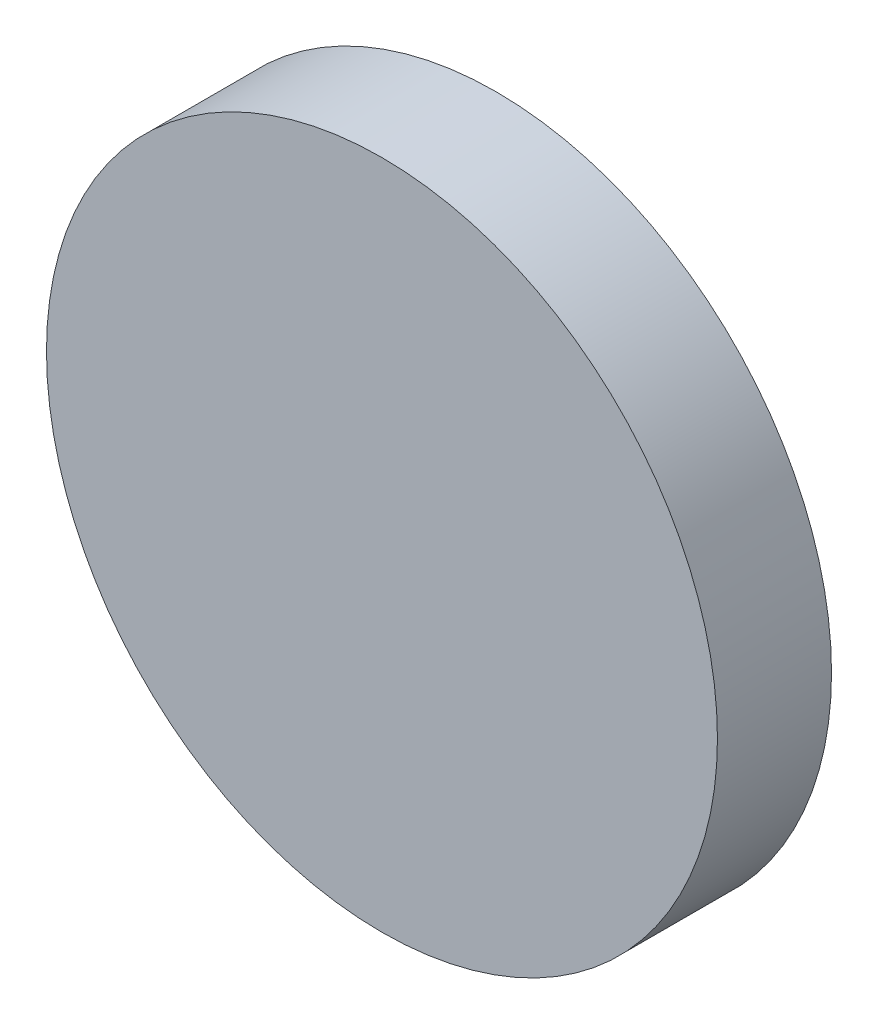
ISO-10303-21;
HEADER;
FILE_DESCRIPTION(('STEP AP214'),'2;1');
FILE_NAME('part.step','',(''),(''),'','','');
FILE_SCHEMA(('AUTOMOTIVE_DESIGN { 1 0 10303 214 1 1 1 1 }'));
ENDSEC;
DATA;
#1=APPLICATION_CONTEXT('core data for automotive mechanical design processes');
#2=APPLICATION_PROTOCOL_DEFINITION('international standard','automotive_design',2000,#1);
#3=PRODUCT_CONTEXT('',#1,'mechanical');
#4=PRODUCT('Part','Part','',(#3));
#5=PRODUCT_RELATED_PRODUCT_CATEGORY('part','',(#4));
#6=PRODUCT_DEFINITION_FORMATION('','',#4);
#7=PRODUCT_DEFINITION_CONTEXT('part definition',#1,'design');
#8=PRODUCT_DEFINITION('design','',#6,#7);
#9=PRODUCT_DEFINITION_SHAPE('','',#8);
#10=(LENGTH_UNIT() NAMED_UNIT(*) SI_UNIT(.MILLI.,.METRE.));
#11=(NAMED_UNIT(*) PLANE_ANGLE_UNIT() SI_UNIT($,.RADIAN.));
#12=(NAMED_UNIT(*) SI_UNIT($,.STERADIAN.) SOLID_ANGLE_UNIT());
#13=UNCERTAINTY_MEASURE_WITH_UNIT(LENGTH_MEASURE(1.E-05),#10,'distance_accuracy_value','');
#14=(GEOMETRIC_REPRESENTATION_CONTEXT(3) GLOBAL_UNCERTAINTY_ASSIGNED_CONTEXT((#13)) GLOBAL_UNIT_ASSIGNED_CONTEXT((#10,
#11,#12)) REPRESENTATION_CONTEXT('',''));
#15=CARTESIAN_POINT('',(0.,0.,0.));
#16=DIRECTION('',(0.,0.,1.));
#17=DIRECTION('',(1.,0.,0.));
#18=AXIS2_PLACEMENT_3D('',#15,#16,#17);
#19=CARTESIAN_POINT('',(0.,0.,8.5));
#20=DIRECTION('',(0.,0.,-1.));
#21=DIRECTION('',(-1.,0.,0.));
#22=AXIS2_PLACEMENT_3D('',#19,#20,#21);
#23=CYLINDRICAL_SURFACE('',#22,25.);
#24=CARTESIAN_POINT('',(0.,0.,8.5));
#25=DIRECTION('',(0.,0.,1.));
#26=DIRECTION('',(1.,0.,0.));
#27=AXIS2_PLACEMENT_3D('',#24,#25,#26);
#28=CIRCLE('',#27,25.);
#29=CARTESIAN_POINT('',(25.,0.,8.5));
#30=VERTEX_POINT('',#29);
#31=EDGE_CURVE('E38',#30,#30,#28,.T.);
#32=ORIENTED_EDGE('',*,*,#31,.F.);
#33=EDGE_LOOP('',(#32));
#34=FACE_BOUND('',#33,.T.);
#35=CARTESIAN_POINT('',(0.,0.,0.));
#36=DIRECTION('',(0.,0.,1.));
#37=DIRECTION('',(1.,0.,0.));
#38=AXIS2_PLACEMENT_3D('',#35,#36,#37);
#39=CIRCLE('',#38,25.);
#40=CARTESIAN_POINT('',(25.,0.,0.));
#41=VERTEX_POINT('',#40);
#42=EDGE_CURVE('E34',#41,#41,#39,.T.);
#43=ORIENTED_EDGE('',*,*,#42,.T.);
#44=EDGE_LOOP('',(#43));
#45=FACE_BOUND('',#44,.T.);
#46=ADVANCED_FACE('F31',(#34,#45),#23,.T.);
#47=CARTESIAN_POINT('',(0.,0.,8.5));
#48=DIRECTION('',(0.,0.,1.));
#49=DIRECTION('',(1.,0.,0.));
#50=AXIS2_PLACEMENT_3D('',#47,#48,#49);
#51=PLANE('',#50);
#52=ORIENTED_EDGE('',*,*,#31,.T.);
#53=EDGE_LOOP('',(#52));
#54=FACE_BOUND('',#53,.T.);
#55=ADVANCED_FACE('F69',(#54),#51,.T.);
#56=CARTESIAN_POINT('',(0.,0.,0.));
#57=DIRECTION('',(0.,0.,1.));
#58=DIRECTION('',(1.,0.,0.));
#59=AXIS2_PLACEMENT_3D('',#56,#57,#58);
#60=PLANE('',#59);
#61=CARTESIAN_POINT('',(0.,0.,0.));
#62=DIRECTION('',(0.,0.,-1.));
#63=DIRECTION('',(-1.,0.,0.));
#64=AXIS2_PLACEMENT_3D('',#61,#62,#63);
#65=CIRCLE('',#64,6.);
#66=CARTESIAN_POINT('',(-6.,0.,0.));
#67=VERTEX_POINT('',#66);
#68=EDGE_CURVE('E10',#67,#67,#65,.T.);
#69=ORIENTED_EDGE('',*,*,#68,.F.);
#70=EDGE_LOOP('',(#69));
#71=FACE_BOUND('',#70,.T.);
#72=ORIENTED_EDGE('',*,*,#42,.F.);
#73=EDGE_LOOP('',(#72));
#74=FACE_BOUND('',#73,.T.);
#75=ADVANCED_FACE('F60',(#71,#74),#60,.F.);
#76=CARTESIAN_POINT('',(0.,0.,-10.));
#77=DIRECTION('',(0.,0.,-1.));
#78=DIRECTION('',(-1.,0.,0.));
#79=AXIS2_PLACEMENT_3D('',#76,#77,#78);
#80=PLANE('',#79);
#81=CARTESIAN_POINT('',(0.,0.,-10.));
#82=DIRECTION('',(0.,0.,-1.));
#83=DIRECTION('',(-1.,0.,0.));
#84=AXIS2_PLACEMENT_3D('',#81,#82,#83);
#85=CIRCLE('',#84,6.);
#86=CARTESIAN_POINT('',(-6.,0.,-10.));
#87=VERTEX_POINT('',#86);
#88=EDGE_CURVE('E44',#87,#87,#85,.T.);
#89=ORIENTED_EDGE('',*,*,#88,.T.);
#90=EDGE_LOOP('',(#89));
#91=FACE_BOUND('',#90,.T.);
#92=CARTESIAN_POINT('',(0.,0.,-10.));
#93=DIRECTION('',(0.,0.,-1.));
#94=DIRECTION('',(-1.,0.,0.));
#95=AXIS2_PLACEMENT_3D('',#92,#93,#94);
#96=CIRCLE('',#95,2.5);
#97=CARTESIAN_POINT('',(-2.5,0.,-10.));
#98=VERTEX_POINT('',#97);
#99=EDGE_CURVE('E47',#98,#98,#96,.T.);
#100=ORIENTED_EDGE('',*,*,#99,.F.);
#101=EDGE_LOOP('',(#100));
#102=FACE_BOUND('',#101,.T.);
#103=ADVANCED_FACE('F57',(#91,#102),#80,.T.);
#104=CARTESIAN_POINT('',(0.,0.,-10.));
#105=DIRECTION('',(0.,0.,1.));
#106=DIRECTION('',(1.,0.,0.));
#107=AXIS2_PLACEMENT_3D('',#104,#105,#106);
#108=CYLINDRICAL_SURFACE('',#107,6.);
#109=ORIENTED_EDGE('',*,*,#88,.F.);
#110=EDGE_LOOP('',(#109));
#111=FACE_BOUND('',#110,.T.);
#112=ORIENTED_EDGE('',*,*,#68,.T.);
#113=EDGE_LOOP('',(#112));
#114=FACE_BOUND('',#113,.T.);
#115=ADVANCED_FACE('F59',(#111,#114),#108,.T.);
#116=CARTESIAN_POINT('',(0.,0.,-10.));
#117=DIRECTION('',(0.,0.,1.));
#118=DIRECTION('',(1.,0.,0.));
#119=AXIS2_PLACEMENT_3D('',#116,#117,#118);
#120=CYLINDRICAL_SURFACE('',#119,2.5);
#121=ORIENTED_EDGE('',*,*,#99,.T.);
#122=EDGE_LOOP('',(#121));
#123=FACE_BOUND('',#122,.T.);
#124=CARTESIAN_POINT('',(0.,0.,0.));
#125=DIRECTION('',(0.,0.,-1.));
#126=DIRECTION('',(-1.,0.,0.));
#127=AXIS2_PLACEMENT_3D('',#124,#125,#126);
#128=CIRCLE('',#127,2.5);
#129=CARTESIAN_POINT('',(-2.5,0.,0.));
#130=VERTEX_POINT('',#129);
#131=EDGE_CURVE('E48',#130,#130,#128,.T.);
#132=ORIENTED_EDGE('',*,*,#131,.F.);
#133=EDGE_LOOP('',(#132));
#134=FACE_BOUND('',#133,.T.);
#135=ADVANCED_FACE('F54',(#123,#134),#120,.F.);
#136=ORIENTED_EDGE('',*,*,#131,.T.);
#137=EDGE_LOOP('',(#136));
#138=FACE_BOUND('',#137,.T.);
#139=ADVANCED_FACE('F71',(#138),#60,.F.);
#140=CLOSED_SHELL('',(#46,#55,#75,#103,#115,#135,#139));
#141=MANIFOLD_SOLID_BREP('B2',#140);
#142=ADVANCED_BREP_SHAPE_REPRESENTATION('',(#18,#141),#14);
#143=SHAPE_DEFINITION_REPRESENTATION(#9,#142);
ENDSEC;
END-ISO-10303-21;
